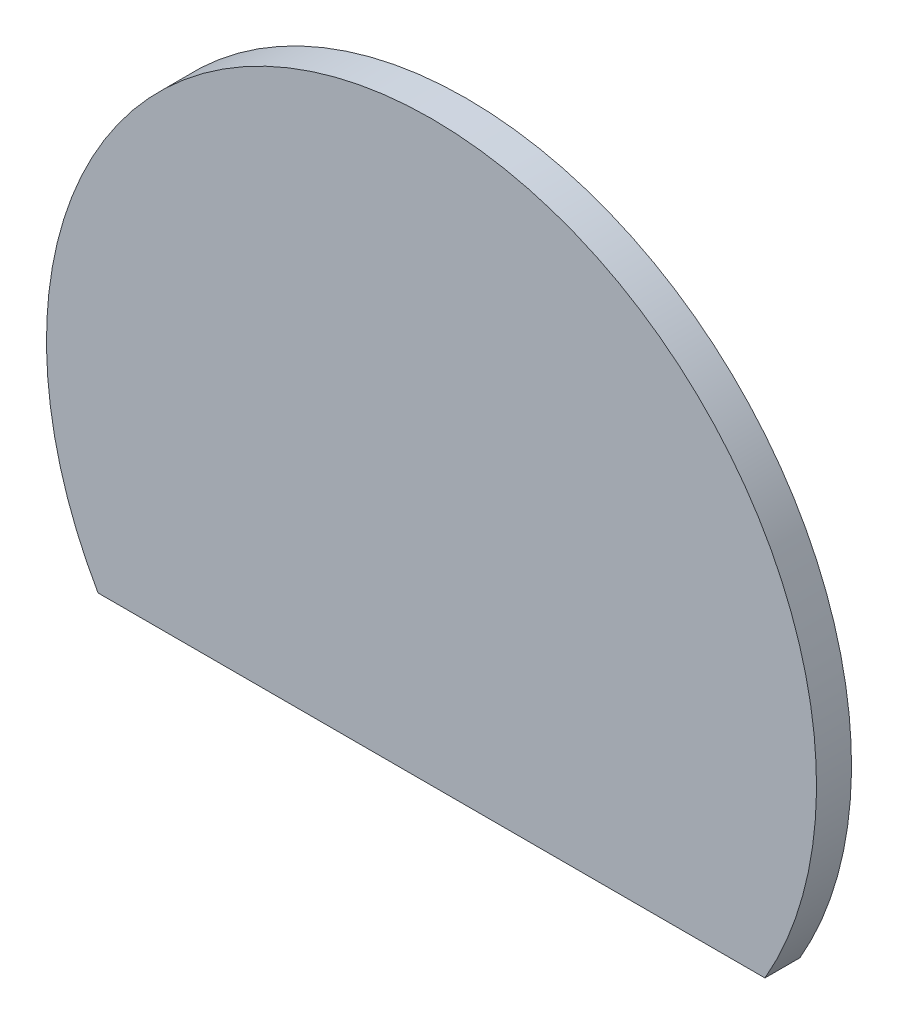
ISO-10303-21;
HEADER;
FILE_DESCRIPTION(('STEP AP214'),'2;1');
FILE_NAME('part.step','',(''),(''),'','','');
FILE_SCHEMA(('AUTOMOTIVE_DESIGN { 1 0 10303 214 1 1 1 1 }'));
ENDSEC;
DATA;
#1=APPLICATION_CONTEXT('core data for automotive mechanical design processes');
#2=APPLICATION_PROTOCOL_DEFINITION('international standard','automotive_design',2000,#1);
#3=PRODUCT_CONTEXT('',#1,'mechanical');
#4=PRODUCT('Part','Part','',(#3));
#5=PRODUCT_RELATED_PRODUCT_CATEGORY('part','',(#4));
#6=PRODUCT_DEFINITION_FORMATION('','',#4);
#7=PRODUCT_DEFINITION_CONTEXT('part definition',#1,'design');
#8=PRODUCT_DEFINITION('design','',#6,#7);
#9=PRODUCT_DEFINITION_SHAPE('','',#8);
#10=(LENGTH_UNIT() NAMED_UNIT(*) SI_UNIT(.MILLI.,.METRE.));
#11=(NAMED_UNIT(*) PLANE_ANGLE_UNIT() SI_UNIT($,.RADIAN.));
#12=(NAMED_UNIT(*) SI_UNIT($,.STERADIAN.) SOLID_ANGLE_UNIT());
#13=UNCERTAINTY_MEASURE_WITH_UNIT(LENGTH_MEASURE(1.E-05),#10,'distance_accuracy_value','');
#14=(GEOMETRIC_REPRESENTATION_CONTEXT(3) GLOBAL_UNCERTAINTY_ASSIGNED_CONTEXT((#13)) GLOBAL_UNIT_ASSIGNED_CONTEXT((#10,
#11,#12)) REPRESENTATION_CONTEXT('',''));
#15=CARTESIAN_POINT('',(0.,0.,0.));
#16=DIRECTION('',(0.,0.,1.));
#17=DIRECTION('',(1.,0.,0.));
#18=AXIS2_PLACEMENT_3D('',#15,#16,#17);
#19=CARTESIAN_POINT('',(0.,-5.5,1.));
#20=DIRECTION('',(0.,1.,0.));
#21=DIRECTION('',(0.,0.,1.));
#22=AXIS2_PLACEMENT_3D('',#19,#20,#21);
#23=PLANE('',#22);
#24=DIRECTION('',(1.,0.,0.));
#25=VECTOR('',#24,1.);
#26=CARTESIAN_POINT('',(0.,-5.5,0.));
#27=LINE('',#26,#25);
#28=CARTESIAN_POINT('',(-9.52627944162883,-5.5,0.));
#29=VERTEX_POINT('',#28);
#30=CARTESIAN_POINT('',(9.52627944162883,-5.5,0.));
#31=VERTEX_POINT('',#30);
#32=EDGE_CURVE('E79',#29,#31,#27,.T.);
#33=ORIENTED_EDGE('',*,*,#32,.T.);
#34=DIRECTION('',(0.,0.,-1.));
#35=VECTOR('',#34,1.);
#36=CARTESIAN_POINT('',(9.52627944162883,-5.5,1.));
#37=LINE('',#36,#35);
#38=CARTESIAN_POINT('',(9.52627944162883,-5.5,1.));
#39=VERTEX_POINT('',#38);
#40=EDGE_CURVE('E76',#39,#31,#37,.T.);
#41=ORIENTED_EDGE('',*,*,#40,.F.);
#42=DIRECTION('',(1.,0.,0.));
#43=VECTOR('',#42,1.);
#44=CARTESIAN_POINT('',(0.,-5.5,1.));
#45=LINE('',#44,#43);
#46=CARTESIAN_POINT('',(-9.52627944162883,-5.5,1.));
#47=VERTEX_POINT('',#46);
#48=EDGE_CURVE('E78',#47,#39,#45,.T.);
#49=ORIENTED_EDGE('',*,*,#48,.F.);
#50=DIRECTION('',(0.,0.,-1.));
#51=VECTOR('',#50,1.);
#52=CARTESIAN_POINT('',(-9.52627944162883,-5.5,1.));
#53=LINE('',#52,#51);
#54=EDGE_CURVE('E73',#47,#29,#53,.T.);
#55=ORIENTED_EDGE('',*,*,#54,.T.);
#56=EDGE_LOOP('',(#33,#41,#49,#55));
#57=FACE_BOUND('',#56,.T.);
#58=ADVANCED_FACE('F45',(#57),#23,.F.);
#59=CARTESIAN_POINT('',(0.,0.,1.));
#60=DIRECTION('',(0.,0.,-1.));
#61=DIRECTION('',(-1.,0.,0.));
#62=AXIS2_PLACEMENT_3D('',#59,#60,#61);
#63=CYLINDRICAL_SURFACE('',#62,11.);
#64=CARTESIAN_POINT('',(0.,0.,0.));
#65=DIRECTION('',(0.,0.,1.));
#66=DIRECTION('',(1.,0.,0.));
#67=AXIS2_PLACEMENT_3D('',#64,#65,#66);
#68=CIRCLE('',#67,11.);
#69=EDGE_CURVE('E68',#31,#29,#68,.T.);
#70=ORIENTED_EDGE('',*,*,#69,.T.);
#71=ORIENTED_EDGE('',*,*,#54,.F.);
#72=CARTESIAN_POINT('',(0.,0.,1.));
#73=DIRECTION('',(0.,0.,1.));
#74=DIRECTION('',(1.,0.,0.));
#75=AXIS2_PLACEMENT_3D('',#72,#73,#74);
#76=CIRCLE('',#75,11.);
#77=EDGE_CURVE('E60',#39,#47,#76,.T.);
#78=ORIENTED_EDGE('',*,*,#77,.F.);
#79=ORIENTED_EDGE('',*,*,#40,.T.);
#80=EDGE_LOOP('',(#70,#71,#78,#79));
#81=FACE_BOUND('',#80,.T.);
#82=ADVANCED_FACE('F72',(#81),#63,.T.);
#83=CARTESIAN_POINT('',(0.,0.,1.));
#84=DIRECTION('',(0.,0.,1.));
#85=DIRECTION('',(1.,0.,0.));
#86=AXIS2_PLACEMENT_3D('',#83,#84,#85);
#87=PLANE('',#86);
#88=ORIENTED_EDGE('',*,*,#48,.T.);
#89=ORIENTED_EDGE('',*,*,#77,.T.);
#90=EDGE_LOOP('',(#88,#89));
#91=FACE_BOUND('',#90,.T.);
#92=ADVANCED_FACE('F99',(#91),#87,.T.);
#93=CARTESIAN_POINT('',(0.,0.,0.));
#94=DIRECTION('',(0.,0.,1.));
#95=DIRECTION('',(1.,0.,0.));
#96=AXIS2_PLACEMENT_3D('',#93,#94,#95);
#97=PLANE('',#96);
#98=CARTESIAN_POINT('',(0.,0.,0.));
#99=DIRECTION('',(0.,0.,1.));
#100=DIRECTION('',(1.,0.,0.));
#101=AXIS2_PLACEMENT_3D('',#98,#99,#100);
#102=CIRCLE('',#101,4.5);
#103=CARTESIAN_POINT('',(4.5,0.,0.));
#104=VERTEX_POINT('',#103);
#105=EDGE_CURVE('E53',#104,#104,#102,.F.);
#106=ORIENTED_EDGE('',*,*,#105,.F.);
#107=EDGE_LOOP('',(#106));
#108=FACE_BOUND('',#107,.T.);
#109=ORIENTED_EDGE('',*,*,#32,.F.);
#110=ORIENTED_EDGE('',*,*,#69,.F.);
#111=EDGE_LOOP('',(#109,#110));
#112=FACE_BOUND('',#111,.T.);
#113=ADVANCED_FACE('F83',(#108,#112),#97,.F.);
#114=CARTESIAN_POINT('',(0.,0.,-2.2));
#115=DIRECTION('',(0.,0.,-1.));
#116=DIRECTION('',(-1.,0.,0.));
#117=AXIS2_PLACEMENT_3D('',#114,#115,#116);
#118=PLANE('',#117);
#119=CARTESIAN_POINT('',(0.,0.,-2.2));
#120=DIRECTION('',(0.,0.,-1.));
#121=DIRECTION('',(-1.,0.,0.));
#122=AXIS2_PLACEMENT_3D('',#119,#120,#121);
#123=CIRCLE('',#122,4.5);
#124=CARTESIAN_POINT('',(-4.5,0.,-2.2));
#125=VERTEX_POINT('',#124);
#126=EDGE_CURVE('E84',#125,#125,#123,.T.);
#127=ORIENTED_EDGE('',*,*,#126,.T.);
#128=EDGE_LOOP('',(#127));
#129=FACE_BOUND('',#128,.T.);
#130=CARTESIAN_POINT('',(0.,0.,-2.2));
#131=DIRECTION('',(0.,0.,-1.));
#132=DIRECTION('',(-1.,0.,0.));
#133=AXIS2_PLACEMENT_3D('',#130,#131,#132);
#134=CIRCLE('',#133,3.5);
#135=CARTESIAN_POINT('',(-3.5,0.,-2.2));
#136=VERTEX_POINT('',#135);
#137=EDGE_CURVE('E87',#136,#136,#134,.T.);
#138=ORIENTED_EDGE('',*,*,#137,.F.);
#139=EDGE_LOOP('',(#138));
#140=FACE_BOUND('',#139,.T.);
#141=ADVANCED_FACE('F98',(#129,#140),#118,.T.);
#142=CARTESIAN_POINT('',(0.,0.,-2.2));
#143=DIRECTION('',(0.,0.,1.));
#144=DIRECTION('',(1.,0.,0.));
#145=AXIS2_PLACEMENT_3D('',#142,#143,#144);
#146=CYLINDRICAL_SURFACE('',#145,4.5);
#147=ORIENTED_EDGE('',*,*,#126,.F.);
#148=EDGE_LOOP('',(#147));
#149=FACE_BOUND('',#148,.T.);
#150=ORIENTED_EDGE('',*,*,#105,.T.);
#151=EDGE_LOOP('',(#150));
#152=FACE_BOUND('',#151,.T.);
#153=ADVANCED_FACE('F95',(#149,#152),#146,.T.);
#154=CARTESIAN_POINT('',(0.,0.,-2.2));
#155=DIRECTION('',(0.,0.,1.));
#156=DIRECTION('',(1.,0.,0.));
#157=AXIS2_PLACEMENT_3D('',#154,#155,#156);
#158=CYLINDRICAL_SURFACE('',#157,3.5);
#159=ORIENTED_EDGE('',*,*,#137,.T.);
#160=EDGE_LOOP('',(#159));
#161=FACE_BOUND('',#160,.T.);
#162=CARTESIAN_POINT('',(0.,0.,0.));
#163=DIRECTION('',(0.,0.,-1.));
#164=DIRECTION('',(-1.,0.,0.));
#165=AXIS2_PLACEMENT_3D('',#162,#163,#164);
#166=CIRCLE('',#165,3.5);
#167=CARTESIAN_POINT('',(-3.5,0.,0.));
#168=VERTEX_POINT('',#167);
#169=EDGE_CURVE('E183',#168,#168,#166,.T.);
#170=ORIENTED_EDGE('',*,*,#169,.F.);
#171=EDGE_LOOP('',(#170));
#172=FACE_BOUND('',#171,.T.);
#173=ADVANCED_FACE('F111',(#161,#172),#158,.F.);
#174=CARTESIAN_POINT('',(0.,0.,0.));
#175=DIRECTION('',(0.,0.,1.));
#176=DIRECTION('',(1.,0.,0.));
#177=AXIS2_PLACEMENT_3D('',#174,#175,#176);
#178=CIRCLE('',#177,1.4);
#179=CARTESIAN_POINT('',(1.4,0.,0.));
#180=VERTEX_POINT('',#179);
#181=EDGE_CURVE('E11',#180,#180,#178,.F.);
#182=ORIENTED_EDGE('',*,*,#181,.F.);
#183=EDGE_LOOP('',(#182));
#184=FACE_BOUND('',#183,.T.);
#185=ORIENTED_EDGE('',*,*,#169,.T.);
#186=EDGE_LOOP('',(#185));
#187=FACE_BOUND('',#186,.T.);
#188=ADVANCED_FACE('F101',(#184,#187),#97,.F.);
#189=CARTESIAN_POINT('',(0.,0.,-3.));
#190=DIRECTION('',(0.,0.,1.));
#191=DIRECTION('',(1.,0.,0.));
#192=AXIS2_PLACEMENT_3D('',#189,#190,#191);
#193=CYLINDRICAL_SURFACE('',#192,1.4);
#194=CARTESIAN_POINT('',(0.,0.,-3.));
#195=DIRECTION('',(0.,0.,-1.));
#196=DIRECTION('',(-1.,0.,0.));
#197=AXIS2_PLACEMENT_3D('',#194,#195,#196);
#198=CIRCLE('',#197,1.4);
#199=CARTESIAN_POINT('',(-1.4,0.,-3.));
#200=VERTEX_POINT('',#199);
#201=EDGE_CURVE('E182',#200,#200,#198,.T.);
#202=ORIENTED_EDGE('',*,*,#201,.F.);
#203=EDGE_LOOP('',(#202));
#204=FACE_BOUND('',#203,.T.);
#205=ORIENTED_EDGE('',*,*,#181,.T.);
#206=EDGE_LOOP('',(#205));
#207=FACE_BOUND('',#206,.T.);
#208=ADVANCED_FACE('F110',(#204,#207),#193,.T.);
#209=CARTESIAN_POINT('',(0.,0.,-3.));
#210=DIRECTION('',(0.,0.,-1.));
#211=DIRECTION('',(-1.,0.,0.));
#212=AXIS2_PLACEMENT_3D('',#209,#210,#211);
#213=PLANE('',#212);
#214=ORIENTED_EDGE('',*,*,#201,.T.);
#215=EDGE_LOOP('',(#214));
#216=FACE_BOUND('',#215,.T.);
#217=ADVANCED_FACE('F167',(#216),#213,.T.);
#218=CLOSED_SHELL('',(#58,#82,#92,#113,#141,#153,#173,#188,#208,#217));
#219=MANIFOLD_SOLID_BREP('B2',#218);
#220=ADVANCED_BREP_SHAPE_REPRESENTATION('',(#18,#219),#14);
#221=SHAPE_DEFINITION_REPRESENTATION(#9,#220);
ENDSEC;
END-ISO-10303-21;
